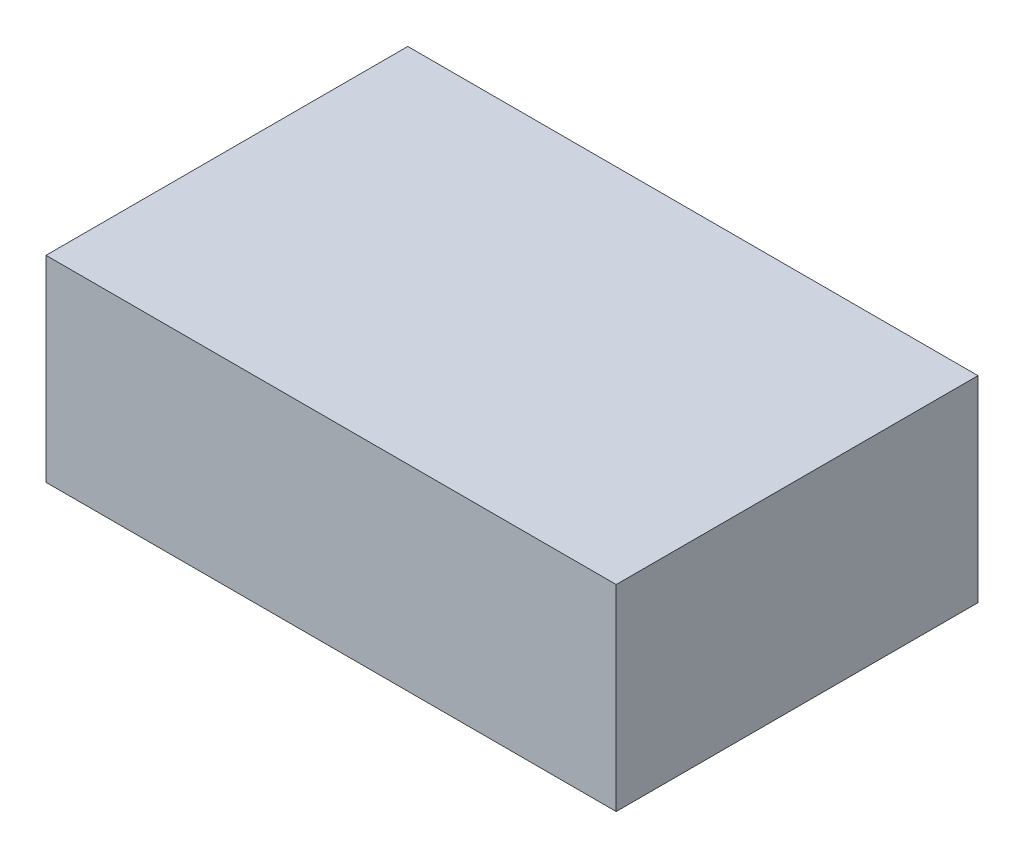
ISO-10303-21;
HEADER;
FILE_DESCRIPTION(('STEP AP214'),'2;1');
FILE_NAME('part.step','',(''),(''),'','','');
FILE_SCHEMA(('AUTOMOTIVE_DESIGN { 1 0 10303 214 1 1 1 1 }'));
ENDSEC;
DATA;
#1=APPLICATION_CONTEXT('core data for automotive mechanical design processes');
#2=APPLICATION_PROTOCOL_DEFINITION('international standard','automotive_design',2000,#1);
#3=PRODUCT_CONTEXT('',#1,'mechanical');
#4=PRODUCT('Part','Part','',(#3));
#5=PRODUCT_RELATED_PRODUCT_CATEGORY('part','',(#4));
#6=PRODUCT_DEFINITION_FORMATION('','',#4);
#7=PRODUCT_DEFINITION_CONTEXT('part definition',#1,'design');
#8=PRODUCT_DEFINITION('design','',#6,#7);
#9=PRODUCT_DEFINITION_SHAPE('','',#8);
#10=(LENGTH_UNIT() NAMED_UNIT(*) SI_UNIT(.MILLI.,.METRE.));
#11=(NAMED_UNIT(*) PLANE_ANGLE_UNIT() SI_UNIT($,.RADIAN.));
#12=(NAMED_UNIT(*) SI_UNIT($,.STERADIAN.) SOLID_ANGLE_UNIT());
#13=UNCERTAINTY_MEASURE_WITH_UNIT(LENGTH_MEASURE(1.E-05),#10,'distance_accuracy_value','');
#14=(GEOMETRIC_REPRESENTATION_CONTEXT(3) GLOBAL_UNCERTAINTY_ASSIGNED_CONTEXT((#13)) GLOBAL_UNIT_ASSIGNED_CONTEXT((#10,
#11,#12)) REPRESENTATION_CONTEXT('',''));
#15=CARTESIAN_POINT('',(0.,0.,0.));
#16=DIRECTION('',(0.,0.,1.));
#17=DIRECTION('',(1.,0.,0.));
#18=AXIS2_PLACEMENT_3D('',#15,#16,#17);
#19=CARTESIAN_POINT('',(72.5,25.,46.));
#20=DIRECTION('',(-1.,0.,0.));
#21=DIRECTION('',(0.,0.,1.));
#22=AXIS2_PLACEMENT_3D('',#19,#20,#21);
#23=PLANE('',#22);
#24=DIRECTION('',(0.,0.,-1.));
#25=VECTOR('',#24,1.);
#26=CARTESIAN_POINT('',(72.5,-25.,46.));
#27=LINE('',#26,#25);
#28=CARTESIAN_POINT('',(72.5,-25.,46.));
#29=VERTEX_POINT('',#28);
#30=CARTESIAN_POINT('',(72.5,-25.,-46.));
#31=VERTEX_POINT('',#30);
#32=EDGE_CURVE('E99',#29,#31,#27,.T.);
#33=ORIENTED_EDGE('',*,*,#32,.T.);
#34=DIRECTION('',(0.,-1.,0.));
#35=VECTOR('',#34,1.);
#36=CARTESIAN_POINT('',(72.5,25.,-46.));
#37=LINE('',#36,#35);
#38=CARTESIAN_POINT('',(72.5,25.,-46.));
#39=VERTEX_POINT('',#38);
#40=EDGE_CURVE('E11',#39,#31,#37,.T.);
#41=ORIENTED_EDGE('',*,*,#40,.F.);
#42=DIRECTION('',(0.,0.,-1.));
#43=VECTOR('',#42,1.);
#44=CARTESIAN_POINT('',(72.5,25.,46.));
#45=LINE('',#44,#43);
#46=CARTESIAN_POINT('',(72.5,25.,46.));
#47=VERTEX_POINT('',#46);
#48=EDGE_CURVE('E87',#47,#39,#45,.T.);
#49=ORIENTED_EDGE('',*,*,#48,.F.);
#50=DIRECTION('',(0.,-1.,0.));
#51=VECTOR('',#50,1.);
#52=CARTESIAN_POINT('',(72.5,25.,46.));
#53=LINE('',#52,#51);
#54=EDGE_CURVE('E95',#47,#29,#53,.T.);
#55=ORIENTED_EDGE('',*,*,#54,.T.);
#56=EDGE_LOOP('',(#33,#41,#49,#55));
#57=FACE_BOUND('',#56,.T.);
#58=ADVANCED_FACE('F36',(#57),#23,.F.);
#59=CARTESIAN_POINT('',(-72.5,25.,-46.));
#60=DIRECTION('',(0.,0.,1.));
#61=DIRECTION('',(1.,0.,0.));
#62=AXIS2_PLACEMENT_3D('',#59,#60,#61);
#63=PLANE('',#62);
#64=DIRECTION('',(-1.,0.,0.));
#65=VECTOR('',#64,1.);
#66=CARTESIAN_POINT('',(-72.5,-25.,-46.));
#67=LINE('',#66,#65);
#68=CARTESIAN_POINT('',(-72.5,-25.,-46.));
#69=VERTEX_POINT('',#68);
#70=EDGE_CURVE('E91',#31,#69,#67,.T.);
#71=ORIENTED_EDGE('',*,*,#70,.T.);
#72=DIRECTION('',(0.,-1.,0.));
#73=VECTOR('',#72,1.);
#74=CARTESIAN_POINT('',(-72.5,25.,-46.));
#75=LINE('',#74,#73);
#76=CARTESIAN_POINT('',(-72.5,25.,-46.));
#77=VERTEX_POINT('',#76);
#78=EDGE_CURVE('E44',#77,#69,#75,.T.);
#79=ORIENTED_EDGE('',*,*,#78,.F.);
#80=DIRECTION('',(-1.,0.,0.));
#81=VECTOR('',#80,1.);
#82=CARTESIAN_POINT('',(-72.5,25.,-46.));
#83=LINE('',#82,#81);
#84=EDGE_CURVE('E82',#39,#77,#83,.T.);
#85=ORIENTED_EDGE('',*,*,#84,.F.);
#86=ORIENTED_EDGE('',*,*,#40,.T.);
#87=EDGE_LOOP('',(#71,#79,#85,#86));
#88=FACE_BOUND('',#87,.T.);
#89=ADVANCED_FACE('F90',(#88),#63,.F.);
#90=CARTESIAN_POINT('',(-72.5,25.,46.));
#91=DIRECTION('',(1.,0.,0.));
#92=DIRECTION('',(0.,0.,-1.));
#93=AXIS2_PLACEMENT_3D('',#90,#91,#92);
#94=PLANE('',#93);
#95=DIRECTION('',(0.,0.,1.));
#96=VECTOR('',#95,1.);
#97=CARTESIAN_POINT('',(-72.5,-25.,46.));
#98=LINE('',#97,#96);
#99=CARTESIAN_POINT('',(-72.5,-25.,46.));
#100=VERTEX_POINT('',#99);
#101=EDGE_CURVE('E69',#69,#100,#98,.T.);
#102=ORIENTED_EDGE('',*,*,#101,.T.);
#103=DIRECTION('',(0.,-1.,0.));
#104=VECTOR('',#103,1.);
#105=CARTESIAN_POINT('',(-72.5,25.,46.));
#106=LINE('',#105,#104);
#107=CARTESIAN_POINT('',(-72.5,25.,46.));
#108=VERTEX_POINT('',#107);
#109=EDGE_CURVE('E92',#108,#100,#106,.T.);
#110=ORIENTED_EDGE('',*,*,#109,.F.);
#111=DIRECTION('',(0.,0.,1.));
#112=VECTOR('',#111,1.);
#113=CARTESIAN_POINT('',(-72.5,25.,46.));
#114=LINE('',#113,#112);
#115=EDGE_CURVE('E85',#77,#108,#114,.T.);
#116=ORIENTED_EDGE('',*,*,#115,.F.);
#117=ORIENTED_EDGE('',*,*,#78,.T.);
#118=EDGE_LOOP('',(#102,#110,#116,#117));
#119=FACE_BOUND('',#118,.T.);
#120=ADVANCED_FACE('F93',(#119),#94,.F.);
#121=CARTESIAN_POINT('',(-72.5,25.,46.));
#122=DIRECTION('',(0.,0.,-1.));
#123=DIRECTION('',(-1.,0.,0.));
#124=AXIS2_PLACEMENT_3D('',#121,#122,#123);
#125=PLANE('',#124);
#126=DIRECTION('',(1.,0.,0.));
#127=VECTOR('',#126,1.);
#128=CARTESIAN_POINT('',(-72.5,-25.,46.));
#129=LINE('',#128,#127);
#130=EDGE_CURVE('E75',#100,#29,#129,.T.);
#131=ORIENTED_EDGE('',*,*,#130,.T.);
#132=ORIENTED_EDGE('',*,*,#54,.F.);
#133=DIRECTION('',(1.,0.,0.));
#134=VECTOR('',#133,1.);
#135=CARTESIAN_POINT('',(-72.5,25.,46.));
#136=LINE('',#135,#134);
#137=EDGE_CURVE('E52',#108,#47,#136,.T.);
#138=ORIENTED_EDGE('',*,*,#137,.F.);
#139=ORIENTED_EDGE('',*,*,#109,.T.);
#140=EDGE_LOOP('',(#131,#132,#138,#139));
#141=FACE_BOUND('',#140,.T.);
#142=ADVANCED_FACE('F106',(#141),#125,.F.);
#143=CARTESIAN_POINT('',(0.,25.,0.));
#144=DIRECTION('',(0.,-1.,0.));
#145=DIRECTION('',(0.,0.,-1.));
#146=AXIS2_PLACEMENT_3D('',#143,#144,#145);
#147=PLANE('',#146);
#148=ORIENTED_EDGE('',*,*,#48,.T.);
#149=ORIENTED_EDGE('',*,*,#84,.T.);
#150=ORIENTED_EDGE('',*,*,#115,.T.);
#151=ORIENTED_EDGE('',*,*,#137,.T.);
#152=EDGE_LOOP('',(#148,#149,#150,#151));
#153=FACE_BOUND('',#152,.T.);
#154=ADVANCED_FACE('F83',(#153),#147,.F.);
#155=CARTESIAN_POINT('',(0.,-25.,0.));
#156=DIRECTION('',(0.,-1.,0.));
#157=DIRECTION('',(0.,0.,-1.));
#158=AXIS2_PLACEMENT_3D('',#155,#156,#157);
#159=PLANE('',#158);
#160=ORIENTED_EDGE('',*,*,#32,.F.);
#161=ORIENTED_EDGE('',*,*,#130,.F.);
#162=ORIENTED_EDGE('',*,*,#101,.F.);
#163=ORIENTED_EDGE('',*,*,#70,.F.);
#164=EDGE_LOOP('',(#160,#161,#162,#163));
#165=FACE_BOUND('',#164,.T.);
#166=ADVANCED_FACE('F109',(#165),#159,.T.);
#167=CLOSED_SHELL('',(#58,#89,#120,#142,#154,#166));
#168=MANIFOLD_SOLID_BREP('B2',#167);
#169=ADVANCED_BREP_SHAPE_REPRESENTATION('',(#18,#168),#14);
#170=SHAPE_DEFINITION_REPRESENTATION(#9,#169);
ENDSEC;
END-ISO-10303-21;
